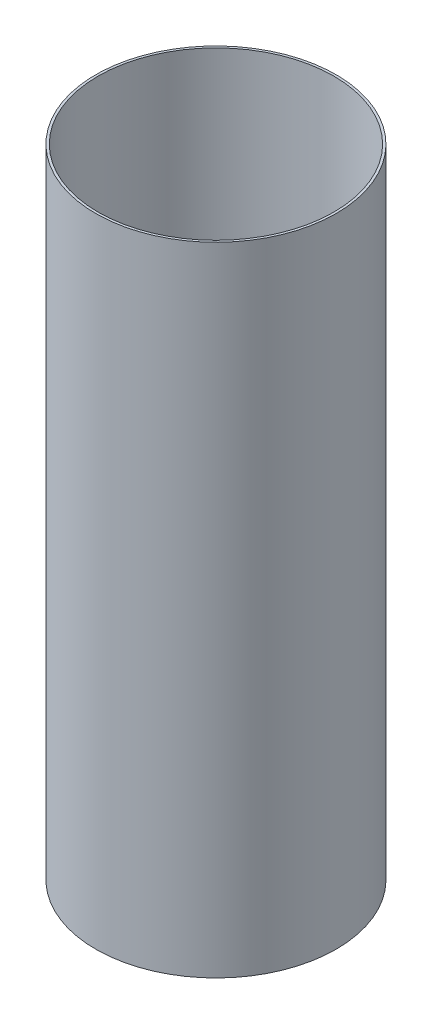
ISO-10303-21;
HEADER;
FILE_DESCRIPTION(('STEP AP214'),'2;1');
FILE_NAME('part.step','',(''),(''),'','','');
FILE_SCHEMA(('AUTOMOTIVE_DESIGN { 1 0 10303 214 1 1 1 1 }'));
ENDSEC;
DATA;
#1=APPLICATION_CONTEXT('core data for automotive mechanical design processes');
#2=APPLICATION_PROTOCOL_DEFINITION('international standard','automotive_design',2000,#1);
#3=PRODUCT_CONTEXT('',#1,'mechanical');
#4=PRODUCT('Part','Part','',(#3));
#5=PRODUCT_RELATED_PRODUCT_CATEGORY('part','',(#4));
#6=PRODUCT_DEFINITION_FORMATION('','',#4);
#7=PRODUCT_DEFINITION_CONTEXT('part definition',#1,'design');
#8=PRODUCT_DEFINITION('design','',#6,#7);
#9=PRODUCT_DEFINITION_SHAPE('','',#8);
#10=(LENGTH_UNIT() NAMED_UNIT(*) SI_UNIT(.MILLI.,.METRE.));
#11=(NAMED_UNIT(*) PLANE_ANGLE_UNIT() SI_UNIT($,.RADIAN.));
#12=(NAMED_UNIT(*) SI_UNIT($,.STERADIAN.) SOLID_ANGLE_UNIT());
#13=UNCERTAINTY_MEASURE_WITH_UNIT(LENGTH_MEASURE(1.E-05),#10,'distance_accuracy_value','');
#14=(GEOMETRIC_REPRESENTATION_CONTEXT(3) GLOBAL_UNCERTAINTY_ASSIGNED_CONTEXT((#13)) GLOBAL_UNIT_ASSIGNED_CONTEXT((#10,
#11,#12)) REPRESENTATION_CONTEXT('',''));
#15=CARTESIAN_POINT('',(0.,0.,0.));
#16=DIRECTION('',(0.,0.,1.));
#17=DIRECTION('',(1.,0.,0.));
#18=AXIS2_PLACEMENT_3D('',#15,#16,#17);
#19=CARTESIAN_POINT('',(0.,274.5994,0.));
#20=DIRECTION('',(0.,-1.,0.));
#21=DIRECTION('',(1.,0.,0.));
#22=AXIS2_PLACEMENT_3D('',#19,#20,#21);
#23=CYLINDRICAL_SURFACE('',#22,50.8);
#24=CARTESIAN_POINT('',(-1.50032763990282E-13,0.,0.));
#25=DIRECTION('',(0.,-1.,0.));
#26=DIRECTION('',(1.,0.,0.));
#27=AXIS2_PLACEMENT_3D('',#24,#25,#26);
#28=CIRCLE('',#27,50.8);
#29=CARTESIAN_POINT('',(50.7999999999998,0.,0.));
#30=VERTEX_POINT('',#29);
#31=EDGE_CURVE('E19',#30,#30,#28,.T.);
#32=ORIENTED_EDGE('',*,*,#31,.T.);
#33=EDGE_LOOP('',(#32));
#34=FACE_BOUND('',#33,.T.);
#35=CARTESIAN_POINT('',(0.,274.5994,0.));
#36=DIRECTION('',(0.,-1.,0.));
#37=DIRECTION('',(1.,0.,0.));
#38=AXIS2_PLACEMENT_3D('',#35,#36,#37);
#39=CIRCLE('',#38,50.8);
#40=CARTESIAN_POINT('',(50.8,274.5994,0.));
#41=VERTEX_POINT('',#40);
#42=EDGE_CURVE('E28',#41,#41,#39,.T.);
#43=ORIENTED_EDGE('',*,*,#42,.F.);
#44=EDGE_LOOP('',(#43));
#45=FACE_BOUND('',#44,.T.);
#46=ADVANCED_FACE('F15',(#34,#45),#23,.F.);
#47=CARTESIAN_POINT('',(-52.437792,0.,-52.437792));
#48=DIRECTION('',(0.,1.,0.));
#49=DIRECTION('',(0.,0.,1.));
#50=AXIS2_PLACEMENT_3D('',#47,#48,#49);
#51=PLANE('',#50);
#52=ORIENTED_EDGE('',*,*,#31,.F.);
#53=EDGE_LOOP('',(#52));
#54=FACE_BOUND('',#53,.T.);
#55=CARTESIAN_POINT('',(-1.47090945088512E-13,0.,0.));
#56=DIRECTION('',(0.,-1.,0.));
#57=DIRECTION('',(1.,0.,0.));
#58=AXIS2_PLACEMENT_3D('',#55,#56,#57);
#59=CIRCLE('',#58,51.816);
#60=CARTESIAN_POINT('',(51.8159999999998,0.,0.));
#61=VERTEX_POINT('',#60);
#62=EDGE_CURVE('E23',#61,#61,#59,.T.);
#63=ORIENTED_EDGE('',*,*,#62,.T.);
#64=EDGE_LOOP('',(#63));
#65=FACE_BOUND('',#64,.T.);
#66=ADVANCED_FACE('F38',(#54,#65),#51,.F.);
#67=CARTESIAN_POINT('',(-52.437792,274.5994,-52.437792));
#68=DIRECTION('',(0.,1.,0.));
#69=DIRECTION('',(0.,0.,1.));
#70=AXIS2_PLACEMENT_3D('',#67,#68,#69);
#71=PLANE('',#70);
#72=ORIENTED_EDGE('',*,*,#42,.T.);
#73=EDGE_LOOP('',(#72));
#74=FACE_BOUND('',#73,.T.);
#75=CARTESIAN_POINT('',(0.,274.5994,0.));
#76=DIRECTION('',(0.,-1.,0.));
#77=DIRECTION('',(1.,0.,0.));
#78=AXIS2_PLACEMENT_3D('',#75,#76,#77);
#79=CIRCLE('',#78,51.816);
#80=CARTESIAN_POINT('',(51.816,274.5994,0.));
#81=VERTEX_POINT('',#80);
#82=EDGE_CURVE('E10',#81,#81,#79,.F.);
#83=ORIENTED_EDGE('',*,*,#82,.T.);
#84=EDGE_LOOP('',(#83));
#85=FACE_BOUND('',#84,.T.);
#86=ADVANCED_FACE('F17',(#74,#85),#71,.T.);
#87=CARTESIAN_POINT('',(0.,274.5994,0.));
#88=DIRECTION('',(0.,-1.,0.));
#89=DIRECTION('',(1.,0.,0.));
#90=AXIS2_PLACEMENT_3D('',#87,#88,#89);
#91=CYLINDRICAL_SURFACE('',#90,51.816);
#92=ORIENTED_EDGE('',*,*,#62,.F.);
#93=EDGE_LOOP('',(#92));
#94=FACE_BOUND('',#93,.T.);
#95=ORIENTED_EDGE('',*,*,#82,.F.);
#96=EDGE_LOOP('',(#95));
#97=FACE_BOUND('',#96,.T.);
#98=ADVANCED_FACE('F43',(#94,#97),#91,.T.);
#99=CLOSED_SHELL('',(#46,#66,#86,#98));
#100=MANIFOLD_SOLID_BREP('B1',#99);
#101=ADVANCED_BREP_SHAPE_REPRESENTATION('',(#18,#100),#14);
#102=SHAPE_DEFINITION_REPRESENTATION(#9,#101);
ENDSEC;
END-ISO-10303-21;
